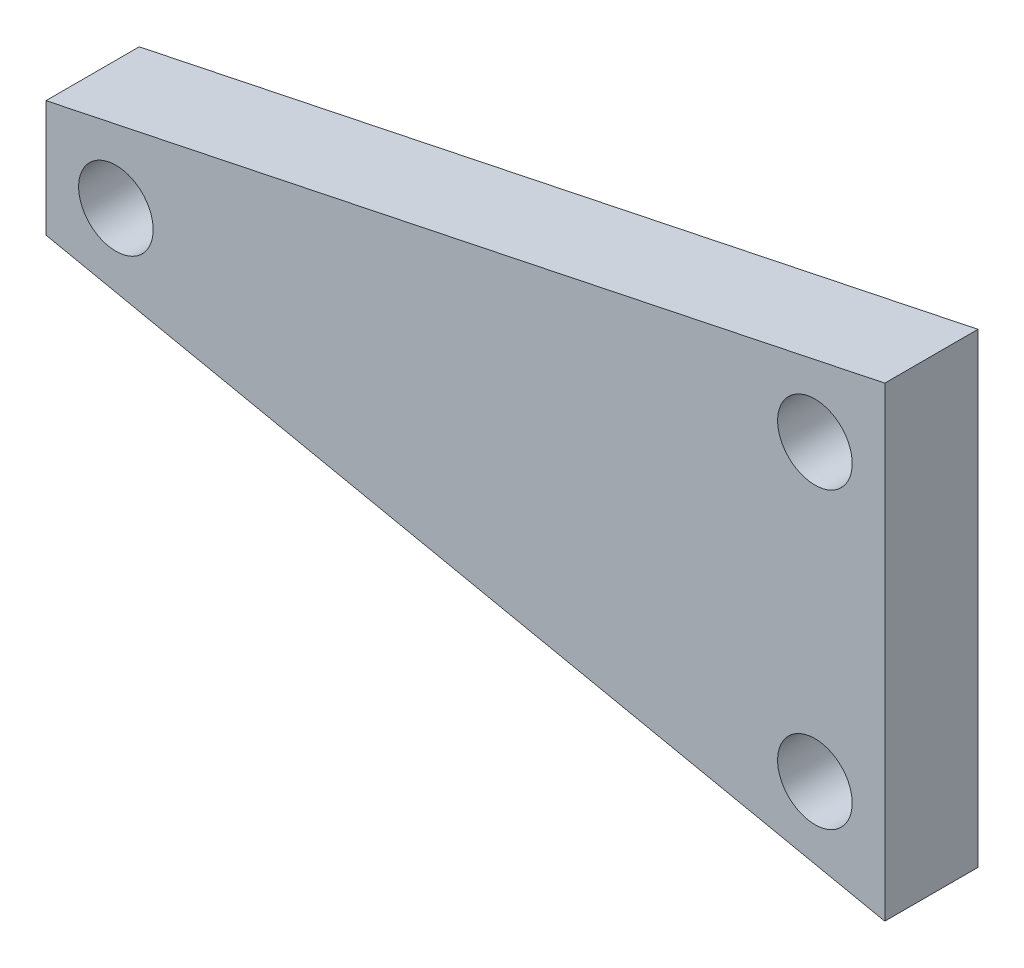
ISO-10303-21;
HEADER;
FILE_DESCRIPTION(('STEP AP214'),'2;1');
FILE_NAME('part.step','',(''),(''),'','','');
FILE_SCHEMA(('AUTOMOTIVE_DESIGN { 1 0 10303 214 1 1 1 1 }'));
ENDSEC;
DATA;
#1=APPLICATION_CONTEXT('core data for automotive mechanical design processes');
#2=APPLICATION_PROTOCOL_DEFINITION('international standard','automotive_design',2000,#1);
#3=PRODUCT_CONTEXT('',#1,'mechanical');
#4=PRODUCT('Part','Part','',(#3));
#5=PRODUCT_RELATED_PRODUCT_CATEGORY('part','',(#4));
#6=PRODUCT_DEFINITION_FORMATION('','',#4);
#7=PRODUCT_DEFINITION_CONTEXT('part definition',#1,'design');
#8=PRODUCT_DEFINITION('design','',#6,#7);
#9=PRODUCT_DEFINITION_SHAPE('','',#8);
#10=(LENGTH_UNIT() NAMED_UNIT(*) SI_UNIT(.MILLI.,.METRE.));
#11=(NAMED_UNIT(*) PLANE_ANGLE_UNIT() SI_UNIT($,.RADIAN.));
#12=(NAMED_UNIT(*) SI_UNIT($,.STERADIAN.) SOLID_ANGLE_UNIT());
#13=UNCERTAINTY_MEASURE_WITH_UNIT(LENGTH_MEASURE(1.E-05),#10,'distance_accuracy_value','');
#14=(GEOMETRIC_REPRESENTATION_CONTEXT(3) GLOBAL_UNCERTAINTY_ASSIGNED_CONTEXT((#13)) GLOBAL_UNIT_ASSIGNED_CONTEXT((#10,
#11,#12)) REPRESENTATION_CONTEXT('',''));
#15=CARTESIAN_POINT('',(0.,0.,0.));
#16=DIRECTION('',(0.,0.,1.));
#17=DIRECTION('',(1.,0.,0.));
#18=AXIS2_PLACEMENT_3D('',#15,#16,#17);
#19=CARTESIAN_POINT('',(0.,0.,4.));
#20=DIRECTION('',(0.,0.,-1.));
#21=DIRECTION('',(-1.,0.,0.));
#22=AXIS2_PLACEMENT_3D('',#19,#20,#21);
#23=PLANE('',#22);
#24=DIRECTION('',(0.978980419737605,-0.203954254112001,0.));
#25=VECTOR('',#24,1.);
#26=CARTESIAN_POINT('',(36.,-7.5,4.));
#27=LINE('',#26,#25);
#28=CARTESIAN_POINT('',(0.,0.,4.));
#29=VERTEX_POINT('',#28);
#30=CARTESIAN_POINT('',(36.,-7.5,4.));
#31=VERTEX_POINT('',#30);
#32=EDGE_CURVE('E92',#29,#31,#27,.T.);
#33=ORIENTED_EDGE('',*,*,#32,.T.);
#34=DIRECTION('',(0.,1.,0.));
#35=VECTOR('',#34,1.);
#36=CARTESIAN_POINT('',(36.,12.5,4.));
#37=LINE('',#36,#35);
#38=CARTESIAN_POINT('',(36.,12.5,4.));
#39=VERTEX_POINT('',#38);
#40=EDGE_CURVE('E87',#31,#39,#37,.T.);
#41=ORIENTED_EDGE('',*,*,#40,.T.);
#42=DIRECTION('',(-0.978980419737605,-0.203954254112001,0.));
#43=VECTOR('',#42,1.);
#44=CARTESIAN_POINT('',(0.,5.,4.));
#45=LINE('',#44,#43);
#46=CARTESIAN_POINT('',(0.,5.,4.));
#47=VERTEX_POINT('',#46);
#48=EDGE_CURVE('E90',#39,#47,#45,.T.);
#49=ORIENTED_EDGE('',*,*,#48,.T.);
#50=DIRECTION('',(0.,-1.,0.));
#51=VECTOR('',#50,1.);
#52=CARTESIAN_POINT('',(0.,0.,4.));
#53=LINE('',#52,#51);
#54=EDGE_CURVE('E57',#47,#29,#53,.T.);
#55=ORIENTED_EDGE('',*,*,#54,.T.);
#56=EDGE_LOOP('',(#33,#41,#49,#55));
#57=FACE_BOUND('',#56,.T.);
#58=CARTESIAN_POINT('',(3.,2.5,4.));
#59=DIRECTION('',(0.,0.,1.));
#60=DIRECTION('',(1.,0.,0.));
#61=AXIS2_PLACEMENT_3D('',#58,#59,#60);
#62=CIRCLE('',#61,1.6);
#63=CARTESIAN_POINT('',(4.6,2.5,4.));
#64=VERTEX_POINT('',#63);
#65=EDGE_CURVE('E112',#64,#64,#62,.T.);
#66=ORIENTED_EDGE('',*,*,#65,.F.);
#67=EDGE_LOOP('',(#66));
#68=FACE_BOUND('',#67,.T.);
#69=CARTESIAN_POINT('',(33.,8.81058733196718,4.));
#70=DIRECTION('',(0.,0.,1.));
#71=DIRECTION('',(1.,0.,0.));
#72=AXIS2_PLACEMENT_3D('',#69,#70,#71);
#73=CIRCLE('',#72,1.6);
#74=CARTESIAN_POINT('',(34.6,8.81058733196718,4.));
#75=VERTEX_POINT('',#74);
#76=EDGE_CURVE('E134',#75,#75,#73,.T.);
#77=ORIENTED_EDGE('',*,*,#76,.F.);
#78=EDGE_LOOP('',(#77));
#79=FACE_BOUND('',#78,.T.);
#80=CARTESIAN_POINT('',(33.,-3.81058733196718,4.));
#81=DIRECTION('',(0.,0.,1.));
#82=DIRECTION('',(1.,0.,0.));
#83=AXIS2_PLACEMENT_3D('',#80,#81,#82);
#84=CIRCLE('',#83,1.60000000000001);
#85=CARTESIAN_POINT('',(34.6,-3.81058733196718,4.));
#86=VERTEX_POINT('',#85);
#87=EDGE_CURVE('E142',#86,#86,#84,.T.);
#88=ORIENTED_EDGE('',*,*,#87,.F.);
#89=EDGE_LOOP('',(#88));
#90=FACE_BOUND('',#89,.T.);
#91=ADVANCED_FACE('F39',(#57,#68,#79,#90),#23,.F.);
#92=CARTESIAN_POINT('',(0.,0.,0.));
#93=DIRECTION('',(0.,0.,-1.));
#94=DIRECTION('',(-1.,0.,0.));
#95=AXIS2_PLACEMENT_3D('',#92,#93,#94);
#96=PLANE('',#95);
#97=CARTESIAN_POINT('',(33.,8.81058733196718,0.));
#98=DIRECTION('',(0.,0.,1.));
#99=DIRECTION('',(1.,0.,0.));
#100=AXIS2_PLACEMENT_3D('',#97,#98,#99);
#101=CIRCLE('',#100,1.6);
#102=CARTESIAN_POINT('',(34.6,8.81058733196718,0.));
#103=VERTEX_POINT('',#102);
#104=EDGE_CURVE('E138',#103,#103,#101,.T.);
#105=ORIENTED_EDGE('',*,*,#104,.T.);
#106=EDGE_LOOP('',(#105));
#107=FACE_BOUND('',#106,.T.);
#108=DIRECTION('',(0.978980419737605,-0.203954254112001,0.));
#109=VECTOR('',#108,1.);
#110=CARTESIAN_POINT('',(36.,-7.5,0.));
#111=LINE('',#110,#109);
#112=CARTESIAN_POINT('',(0.,0.,0.));
#113=VERTEX_POINT('',#112);
#114=CARTESIAN_POINT('',(36.,-7.5,0.));
#115=VERTEX_POINT('',#114);
#116=EDGE_CURVE('E108',#113,#115,#111,.T.);
#117=ORIENTED_EDGE('',*,*,#116,.F.);
#118=DIRECTION('',(0.,-1.,0.));
#119=VECTOR('',#118,1.);
#120=CARTESIAN_POINT('',(0.,0.,0.));
#121=LINE('',#120,#119);
#122=CARTESIAN_POINT('',(0.,5.,0.));
#123=VERTEX_POINT('',#122);
#124=EDGE_CURVE('E80',#123,#113,#121,.T.);
#125=ORIENTED_EDGE('',*,*,#124,.F.);
#126=DIRECTION('',(-0.978980419737605,-0.203954254112001,0.));
#127=VECTOR('',#126,1.);
#128=CARTESIAN_POINT('',(0.,5.,0.));
#129=LINE('',#128,#127);
#130=CARTESIAN_POINT('',(36.,12.5,0.));
#131=VERTEX_POINT('',#130);
#132=EDGE_CURVE('E74',#131,#123,#129,.T.);
#133=ORIENTED_EDGE('',*,*,#132,.F.);
#134=DIRECTION('',(0.,1.,0.));
#135=VECTOR('',#134,1.);
#136=CARTESIAN_POINT('',(36.,12.5,0.));
#137=LINE('',#136,#135);
#138=EDGE_CURVE('E97',#115,#131,#137,.T.);
#139=ORIENTED_EDGE('',*,*,#138,.F.);
#140=EDGE_LOOP('',(#117,#125,#133,#139));
#141=FACE_BOUND('',#140,.T.);
#142=CARTESIAN_POINT('',(3.,2.5,0.));
#143=DIRECTION('',(0.,0.,1.));
#144=DIRECTION('',(1.,0.,0.));
#145=AXIS2_PLACEMENT_3D('',#142,#143,#144);
#146=CIRCLE('',#145,1.6);
#147=CARTESIAN_POINT('',(4.6,2.5,0.));
#148=VERTEX_POINT('',#147);
#149=EDGE_CURVE('E130',#148,#148,#146,.T.);
#150=ORIENTED_EDGE('',*,*,#149,.T.);
#151=EDGE_LOOP('',(#150));
#152=FACE_BOUND('',#151,.T.);
#153=CARTESIAN_POINT('',(33.,-3.81058733196718,0.));
#154=DIRECTION('',(0.,0.,1.));
#155=DIRECTION('',(1.,0.,0.));
#156=AXIS2_PLACEMENT_3D('',#153,#154,#155);
#157=CIRCLE('',#156,1.60000000000001);
#158=CARTESIAN_POINT('',(34.6,-3.81058733196718,0.));
#159=VERTEX_POINT('',#158);
#160=EDGE_CURVE('E146',#159,#159,#157,.T.);
#161=ORIENTED_EDGE('',*,*,#160,.T.);
#162=EDGE_LOOP('',(#161));
#163=FACE_BOUND('',#162,.T.);
#164=ADVANCED_FACE('F125',(#107,#141,#152,#163),#96,.T.);
#165=CARTESIAN_POINT('',(36.,-7.5,4.));
#166=DIRECTION('',(0.203954254112001,0.978980419737605,0.));
#167=DIRECTION('',(-0.978980419737605,0.203954254112001,0.));
#168=AXIS2_PLACEMENT_3D('',#165,#166,#167);
#169=PLANE('',#168);
#170=ORIENTED_EDGE('',*,*,#116,.T.);
#171=DIRECTION('',(0.,0.,-1.));
#172=VECTOR('',#171,1.);
#173=CARTESIAN_POINT('',(36.,-7.5,4.));
#174=LINE('',#173,#172);
#175=EDGE_CURVE('E11',#31,#115,#174,.T.);
#176=ORIENTED_EDGE('',*,*,#175,.F.);
#177=ORIENTED_EDGE('',*,*,#32,.F.);
#178=DIRECTION('',(0.,0.,-1.));
#179=VECTOR('',#178,1.);
#180=CARTESIAN_POINT('',(0.,0.,4.));
#181=LINE('',#180,#179);
#182=EDGE_CURVE('E104',#29,#113,#181,.T.);
#183=ORIENTED_EDGE('',*,*,#182,.T.);
#184=EDGE_LOOP('',(#170,#176,#177,#183));
#185=FACE_BOUND('',#184,.T.);
#186=ADVANCED_FACE('F41',(#185),#169,.F.);
#187=CARTESIAN_POINT('',(36.,12.5,4.));
#188=DIRECTION('',(-1.,0.,0.));
#189=DIRECTION('',(0.,0.,1.));
#190=AXIS2_PLACEMENT_3D('',#187,#188,#189);
#191=PLANE('',#190);
#192=ORIENTED_EDGE('',*,*,#138,.T.);
#193=DIRECTION('',(0.,0.,-1.));
#194=VECTOR('',#193,1.);
#195=CARTESIAN_POINT('',(36.,12.5,4.));
#196=LINE('',#195,#194);
#197=EDGE_CURVE('E49',#39,#131,#196,.T.);
#198=ORIENTED_EDGE('',*,*,#197,.F.);
#199=ORIENTED_EDGE('',*,*,#40,.F.);
#200=ORIENTED_EDGE('',*,*,#175,.T.);
#201=EDGE_LOOP('',(#192,#198,#199,#200));
#202=FACE_BOUND('',#201,.T.);
#203=ADVANCED_FACE('F96',(#202),#191,.F.);
#204=CARTESIAN_POINT('',(0.,5.,4.));
#205=DIRECTION('',(0.203954254112001,-0.978980419737605,0.));
#206=DIRECTION('',(0.978980419737605,0.203954254112001,0.));
#207=AXIS2_PLACEMENT_3D('',#204,#205,#206);
#208=PLANE('',#207);
#209=ORIENTED_EDGE('',*,*,#132,.T.);
#210=DIRECTION('',(0.,0.,-1.));
#211=VECTOR('',#210,1.);
#212=CARTESIAN_POINT('',(0.,5.,4.));
#213=LINE('',#212,#211);
#214=EDGE_CURVE('E99',#47,#123,#213,.T.);
#215=ORIENTED_EDGE('',*,*,#214,.F.);
#216=ORIENTED_EDGE('',*,*,#48,.F.);
#217=ORIENTED_EDGE('',*,*,#197,.T.);
#218=EDGE_LOOP('',(#209,#215,#216,#217));
#219=FACE_BOUND('',#218,.T.);
#220=ADVANCED_FACE('F100',(#219),#208,.F.);
#221=CARTESIAN_POINT('',(0.,0.,4.));
#222=DIRECTION('',(1.,0.,0.));
#223=DIRECTION('',(0.,0.,-1.));
#224=AXIS2_PLACEMENT_3D('',#221,#222,#223);
#225=PLANE('',#224);
#226=ORIENTED_EDGE('',*,*,#124,.T.);
#227=ORIENTED_EDGE('',*,*,#182,.F.);
#228=ORIENTED_EDGE('',*,*,#54,.F.);
#229=ORIENTED_EDGE('',*,*,#214,.T.);
#230=EDGE_LOOP('',(#226,#227,#228,#229));
#231=FACE_BOUND('',#230,.T.);
#232=ADVANCED_FACE('F122',(#231),#225,.F.);
#233=CARTESIAN_POINT('',(3.,2.5,4.));
#234=DIRECTION('',(0.,0.,-1.));
#235=DIRECTION('',(-1.,0.,0.));
#236=AXIS2_PLACEMENT_3D('',#233,#234,#235);
#237=CYLINDRICAL_SURFACE('',#236,1.6);
#238=ORIENTED_EDGE('',*,*,#65,.T.);
#239=EDGE_LOOP('',(#238));
#240=FACE_BOUND('',#239,.T.);
#241=ORIENTED_EDGE('',*,*,#149,.F.);
#242=EDGE_LOOP('',(#241));
#243=FACE_BOUND('',#242,.T.);
#244=ADVANCED_FACE('F165',(#240,#243),#237,.F.);
#245=CARTESIAN_POINT('',(33.,8.81058733196718,4.));
#246=DIRECTION('',(0.,0.,-1.));
#247=DIRECTION('',(-1.,0.,0.));
#248=AXIS2_PLACEMENT_3D('',#245,#246,#247);
#249=CYLINDRICAL_SURFACE('',#248,1.6);
#250=ORIENTED_EDGE('',*,*,#76,.T.);
#251=EDGE_LOOP('',(#250));
#252=FACE_BOUND('',#251,.T.);
#253=ORIENTED_EDGE('',*,*,#104,.F.);
#254=EDGE_LOOP('',(#253));
#255=FACE_BOUND('',#254,.T.);
#256=ADVANCED_FACE('F211',(#252,#255),#249,.F.);
#257=CARTESIAN_POINT('',(33.,-3.81058733196718,4.));
#258=DIRECTION('',(0.,0.,-1.));
#259=DIRECTION('',(-1.,0.,0.));
#260=AXIS2_PLACEMENT_3D('',#257,#258,#259);
#261=CYLINDRICAL_SURFACE('',#260,1.60000000000001);
#262=ORIENTED_EDGE('',*,*,#87,.T.);
#263=EDGE_LOOP('',(#262));
#264=FACE_BOUND('',#263,.T.);
#265=ORIENTED_EDGE('',*,*,#160,.F.);
#266=EDGE_LOOP('',(#265));
#267=FACE_BOUND('',#266,.T.);
#268=ADVANCED_FACE('F154',(#264,#267),#261,.F.);
#269=CLOSED_SHELL('',(#91,#164,#186,#203,#220,#232,#244,#256,#268));
#270=MANIFOLD_SOLID_BREP('B2',#269);
#271=ADVANCED_BREP_SHAPE_REPRESENTATION('',(#18,#270),#14);
#272=SHAPE_DEFINITION_REPRESENTATION(#9,#271);
ENDSEC;
END-ISO-10303-21;
